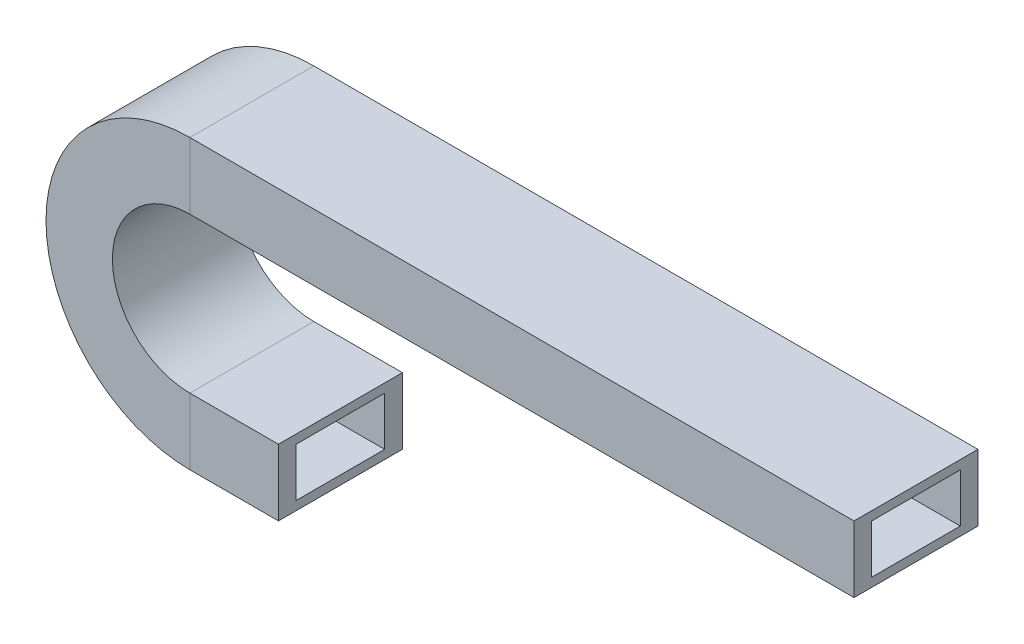
ISO-10303-21;
HEADER;
FILE_DESCRIPTION(('STEP AP214'),'2;1');
FILE_NAME('part.step','',(''),(''),'','','');
FILE_SCHEMA(('AUTOMOTIVE_DESIGN { 1 0 10303 214 1 1 1 1 }'));
ENDSEC;
DATA;
#1=APPLICATION_CONTEXT('core data for automotive mechanical design processes');
#2=APPLICATION_PROTOCOL_DEFINITION('international standard','automotive_design',2000,#1);
#3=PRODUCT_CONTEXT('',#1,'mechanical');
#4=PRODUCT('Part','Part','',(#3));
#5=PRODUCT_RELATED_PRODUCT_CATEGORY('part','',(#4));
#6=PRODUCT_DEFINITION_FORMATION('','',#4);
#7=PRODUCT_DEFINITION_CONTEXT('part definition',#1,'design');
#8=PRODUCT_DEFINITION('design','',#6,#7);
#9=PRODUCT_DEFINITION_SHAPE('','',#8);
#10=(LENGTH_UNIT() NAMED_UNIT(*) SI_UNIT(.MILLI.,.METRE.));
#11=(NAMED_UNIT(*) PLANE_ANGLE_UNIT() SI_UNIT($,.RADIAN.));
#12=(NAMED_UNIT(*) SI_UNIT($,.STERADIAN.) SOLID_ANGLE_UNIT());
#13=UNCERTAINTY_MEASURE_WITH_UNIT(LENGTH_MEASURE(1.E-05),#10,'distance_accuracy_value','');
#14=(GEOMETRIC_REPRESENTATION_CONTEXT(3) GLOBAL_UNCERTAINTY_ASSIGNED_CONTEXT((#13)) GLOBAL_UNIT_ASSIGNED_CONTEXT((#10,
#11,#12)) REPRESENTATION_CONTEXT('',''));
#15=CARTESIAN_POINT('',(0.,0.,0.));
#16=DIRECTION('',(0.,0.,1.));
#17=DIRECTION('',(1.,0.,0.));
#18=AXIS2_PLACEMENT_3D('',#15,#16,#17);
#19=CARTESIAN_POINT('',(0.,7.5,14.));
#20=DIRECTION('',(0.,0.,-1.));
#21=DIRECTION('',(0.,1.,0.));
#22=AXIS2_PLACEMENT_3D('',#19,#20,#21);
#23=PLANE('',#22);
#24=DIRECTION('',(-1.,0.,0.));
#25=VECTOR('',#24,1.);
#26=CARTESIAN_POINT('',(0.,-7.5,14.));
#27=LINE('',#26,#25);
#28=CARTESIAN_POINT('',(0.,-7.5,14.));
#29=VERTEX_POINT('',#28);
#30=CARTESIAN_POINT('',(-20.,-7.5,14.));
#31=VERTEX_POINT('',#30);
#32=EDGE_CURVE('E178',#29,#31,#27,.T.);
#33=ORIENTED_EDGE('',*,*,#32,.F.);
#34=DIRECTION('',(0.,-1.,0.));
#35=VECTOR('',#34,1.);
#36=CARTESIAN_POINT('',(0.,7.5,14.));
#37=LINE('',#36,#35);
#38=CARTESIAN_POINT('',(0.,7.5,14.));
#39=VERTEX_POINT('',#38);
#40=EDGE_CURVE('E207',#39,#29,#37,.T.);
#41=ORIENTED_EDGE('',*,*,#40,.F.);
#42=DIRECTION('',(-1.,0.,0.));
#43=VECTOR('',#42,1.);
#44=CARTESIAN_POINT('',(0.,7.5,14.));
#45=LINE('',#44,#43);
#46=CARTESIAN_POINT('',(-20.,7.5,14.));
#47=VERTEX_POINT('',#46);
#48=EDGE_CURVE('E204',#39,#47,#45,.T.);
#49=ORIENTED_EDGE('',*,*,#48,.T.);
#50=DIRECTION('',(0.,-1.,0.));
#51=VECTOR('',#50,1.);
#52=CARTESIAN_POINT('',(-20.,7.5,14.));
#53=LINE('',#52,#51);
#54=EDGE_CURVE('E200',#47,#31,#53,.T.);
#55=ORIENTED_EDGE('',*,*,#54,.T.);
#56=EDGE_LOOP('',(#33,#41,#49,#55));
#57=FACE_BOUND('',#56,.T.);
#58=ADVANCED_FACE('F35',(#57),#23,.F.);
#59=CARTESIAN_POINT('',(0.,-7.5,14.));
#60=DIRECTION('',(0.,1.,0.));
#61=DIRECTION('',(-1.,0.,0.));
#62=AXIS2_PLACEMENT_3D('',#59,#60,#61);
#63=PLANE('',#62);
#64=DIRECTION('',(-1.,0.,0.));
#65=VECTOR('',#64,1.);
#66=CARTESIAN_POINT('',(0.,-7.5,-14.));
#67=LINE('',#66,#65);
#68=CARTESIAN_POINT('',(0.,-7.5,-14.));
#69=VERTEX_POINT('',#68);
#70=CARTESIAN_POINT('',(-20.,-7.5,-14.));
#71=VERTEX_POINT('',#70);
#72=EDGE_CURVE('E142',#69,#71,#67,.T.);
#73=ORIENTED_EDGE('',*,*,#72,.F.);
#74=DIRECTION('',(0.,0.,-1.));
#75=VECTOR('',#74,1.);
#76=CARTESIAN_POINT('',(0.,-7.5,14.));
#77=LINE('',#76,#75);
#78=EDGE_CURVE('E161',#29,#69,#77,.T.);
#79=ORIENTED_EDGE('',*,*,#78,.F.);
#80=ORIENTED_EDGE('',*,*,#32,.T.);
#81=DIRECTION('',(0.,0.,-1.));
#82=VECTOR('',#81,1.);
#83=CARTESIAN_POINT('',(-20.,-7.5,14.));
#84=LINE('',#83,#82);
#85=EDGE_CURVE('E145',#31,#71,#84,.T.);
#86=ORIENTED_EDGE('',*,*,#85,.T.);
#87=EDGE_LOOP('',(#73,#79,#80,#86));
#88=FACE_BOUND('',#87,.T.);
#89=ADVANCED_FACE('F385',(#88),#63,.F.);
#90=CARTESIAN_POINT('',(0.,7.5,-14.));
#91=DIRECTION('',(0.,0.,1.));
#92=DIRECTION('',(0.,-1.,0.));
#93=AXIS2_PLACEMENT_3D('',#90,#91,#92);
#94=PLANE('',#93);
#95=DIRECTION('',(-1.,0.,0.));
#96=VECTOR('',#95,1.);
#97=CARTESIAN_POINT('',(0.,7.5,-14.));
#98=LINE('',#97,#96);
#99=CARTESIAN_POINT('',(0.,7.5,-14.));
#100=VERTEX_POINT('',#99);
#101=CARTESIAN_POINT('',(-20.,7.5,-14.));
#102=VERTEX_POINT('',#101);
#103=EDGE_CURVE('E132',#100,#102,#98,.T.);
#104=ORIENTED_EDGE('',*,*,#103,.F.);
#105=DIRECTION('',(0.,1.,0.));
#106=VECTOR('',#105,1.);
#107=CARTESIAN_POINT('',(0.,7.5,-14.));
#108=LINE('',#107,#106);
#109=EDGE_CURVE('E155',#69,#100,#108,.T.);
#110=ORIENTED_EDGE('',*,*,#109,.F.);
#111=ORIENTED_EDGE('',*,*,#72,.T.);
#112=DIRECTION('',(0.,1.,0.));
#113=VECTOR('',#112,1.);
#114=CARTESIAN_POINT('',(-20.,7.5,-14.));
#115=LINE('',#114,#113);
#116=EDGE_CURVE('E116',#71,#102,#115,.T.);
#117=ORIENTED_EDGE('',*,*,#116,.T.);
#118=EDGE_LOOP('',(#104,#110,#111,#117));
#119=FACE_BOUND('',#118,.T.);
#120=ADVANCED_FACE('F140',(#119),#94,.F.);
#121=CARTESIAN_POINT('',(0.,7.5,14.));
#122=DIRECTION('',(0.,-1.,0.));
#123=DIRECTION('',(1.,0.,0.));
#124=AXIS2_PLACEMENT_3D('',#121,#122,#123);
#125=PLANE('',#124);
#126=DIRECTION('',(0.,0.,1.));
#127=VECTOR('',#126,1.);
#128=CARTESIAN_POINT('',(-20.,7.5,14.));
#129=LINE('',#128,#127);
#130=EDGE_CURVE('E124',#102,#47,#129,.T.);
#131=ORIENTED_EDGE('',*,*,#130,.T.);
#132=ORIENTED_EDGE('',*,*,#48,.F.);
#133=DIRECTION('',(0.,0.,1.));
#134=VECTOR('',#133,1.);
#135=CARTESIAN_POINT('',(0.,7.5,14.));
#136=LINE('',#135,#134);
#137=EDGE_CURVE('E136',#100,#39,#136,.T.);
#138=ORIENTED_EDGE('',*,*,#137,.F.);
#139=ORIENTED_EDGE('',*,*,#103,.T.);
#140=EDGE_LOOP('',(#131,#132,#138,#139));
#141=FACE_BOUND('',#140,.T.);
#142=ADVANCED_FACE('F135',(#141),#125,.F.);
#143=CARTESIAN_POINT('',(-20.,7.5,14.));
#144=DIRECTION('',(0.,0.,-1.));
#145=DIRECTION('',(-1.,0.,0.));
#146=AXIS2_PLACEMENT_3D('',#143,#144,#145);
#147=PLANE('',#146);
#148=CARTESIAN_POINT('',(-20.,25.,14.));
#149=DIRECTION('',(0.,0.,-1.));
#150=DIRECTION('',(0.,-1.,0.));
#151=AXIS2_PLACEMENT_3D('',#148,#149,#150);
#152=CIRCLE('',#151,32.5);
#153=CARTESIAN_POINT('',(-20.,57.5,14.));
#154=VERTEX_POINT('',#153);
#155=EDGE_CURVE('E182',#31,#154,#152,.T.);
#156=ORIENTED_EDGE('',*,*,#155,.F.);
#157=ORIENTED_EDGE('',*,*,#54,.F.);
#158=CARTESIAN_POINT('',(-20.,25.,14.));
#159=DIRECTION('',(0.,0.,-1.));
#160=DIRECTION('',(0.,-1.,0.));
#161=AXIS2_PLACEMENT_3D('',#158,#159,#160);
#162=CIRCLE('',#161,17.5);
#163=CARTESIAN_POINT('',(-20.,42.5,14.));
#164=VERTEX_POINT('',#163);
#165=EDGE_CURVE('E128',#47,#164,#162,.T.);
#166=ORIENTED_EDGE('',*,*,#165,.T.);
#167=DIRECTION('',(0.,1.,0.));
#168=VECTOR('',#167,1.);
#169=CARTESIAN_POINT('',(-20.,42.5,14.));
#170=LINE('',#169,#168);
#171=EDGE_CURVE('E194',#164,#154,#170,.T.);
#172=ORIENTED_EDGE('',*,*,#171,.T.);
#173=EDGE_LOOP('',(#156,#157,#166,#172));
#174=FACE_BOUND('',#173,.T.);
#175=ADVANCED_FACE('F198',(#174),#147,.F.);
#176=CARTESIAN_POINT('',(-20.,25.,0.));
#177=DIRECTION('',(0.,0.,-1.));
#178=DIRECTION('',(-1.,0.,0.));
#179=AXIS2_PLACEMENT_3D('',#176,#177,#178);
#180=CYLINDRICAL_SURFACE('',#179,32.5);
#181=CARTESIAN_POINT('',(-20.,25.,-14.));
#182=DIRECTION('',(0.,0.,-1.));
#183=DIRECTION('',(0.,-1.,0.));
#184=AXIS2_PLACEMENT_3D('',#181,#182,#183);
#185=CIRCLE('',#184,32.5);
#186=CARTESIAN_POINT('',(-20.,57.5,-14.));
#187=VERTEX_POINT('',#186);
#188=EDGE_CURVE('E151',#71,#187,#185,.T.);
#189=ORIENTED_EDGE('',*,*,#188,.F.);
#190=ORIENTED_EDGE('',*,*,#85,.F.);
#191=ORIENTED_EDGE('',*,*,#155,.T.);
#192=DIRECTION('',(0.,0.,-1.));
#193=VECTOR('',#192,1.);
#194=CARTESIAN_POINT('',(-20.,57.5,14.));
#195=LINE('',#194,#193);
#196=EDGE_CURVE('E180',#154,#187,#195,.T.);
#197=ORIENTED_EDGE('',*,*,#196,.T.);
#198=EDGE_LOOP('',(#189,#190,#191,#197));
#199=FACE_BOUND('',#198,.T.);
#200=ADVANCED_FACE('F186',(#199),#180,.T.);
#201=CARTESIAN_POINT('',(-20.,7.5,-14.));
#202=DIRECTION('',(0.,0.,1.));
#203=DIRECTION('',(1.,0.,0.));
#204=AXIS2_PLACEMENT_3D('',#201,#202,#203);
#205=PLANE('',#204);
#206=CARTESIAN_POINT('',(-20.,25.,-14.));
#207=DIRECTION('',(0.,0.,-1.));
#208=DIRECTION('',(0.,-1.,0.));
#209=AXIS2_PLACEMENT_3D('',#206,#207,#208);
#210=CIRCLE('',#209,17.5);
#211=CARTESIAN_POINT('',(-20.,42.5,-14.));
#212=VERTEX_POINT('',#211);
#213=EDGE_CURVE('E111',#102,#212,#210,.T.);
#214=ORIENTED_EDGE('',*,*,#213,.F.);
#215=ORIENTED_EDGE('',*,*,#116,.F.);
#216=ORIENTED_EDGE('',*,*,#188,.T.);
#217=DIRECTION('',(0.,-1.,0.));
#218=VECTOR('',#217,1.);
#219=CARTESIAN_POINT('',(-20.,42.5,-14.));
#220=LINE('',#219,#218);
#221=EDGE_CURVE('E119',#187,#212,#220,.T.);
#222=ORIENTED_EDGE('',*,*,#221,.T.);
#223=EDGE_LOOP('',(#214,#215,#216,#222));
#224=FACE_BOUND('',#223,.T.);
#225=ADVANCED_FACE('F113',(#224),#205,.F.);
#226=CARTESIAN_POINT('',(-20.,25.,0.));
#227=DIRECTION('',(0.,0.,-1.));
#228=DIRECTION('',(-1.,0.,0.));
#229=AXIS2_PLACEMENT_3D('',#226,#227,#228);
#230=CYLINDRICAL_SURFACE('',#229,17.5);
#231=DIRECTION('',(0.,0.,1.));
#232=VECTOR('',#231,1.);
#233=CARTESIAN_POINT('',(-20.,42.5,14.));
#234=LINE('',#233,#232);
#235=EDGE_CURVE('E39',#212,#164,#234,.T.);
#236=ORIENTED_EDGE('',*,*,#235,.T.);
#237=ORIENTED_EDGE('',*,*,#165,.F.);
#238=ORIENTED_EDGE('',*,*,#130,.F.);
#239=ORIENTED_EDGE('',*,*,#213,.T.);
#240=EDGE_LOOP('',(#236,#237,#238,#239));
#241=FACE_BOUND('',#240,.T.);
#242=ADVANCED_FACE('F126',(#241),#230,.F.);
#243=CARTESIAN_POINT('',(-20.,42.5,14.));
#244=DIRECTION('',(0.,0.,-1.));
#245=DIRECTION('',(0.,1.,0.));
#246=AXIS2_PLACEMENT_3D('',#243,#244,#245);
#247=PLANE('',#246);
#248=DIRECTION('',(1.,0.,0.));
#249=VECTOR('',#248,1.);
#250=CARTESIAN_POINT('',(-20.,57.5,14.));
#251=LINE('',#250,#249);
#252=CARTESIAN_POINT('',(130.,57.5,14.));
#253=VERTEX_POINT('',#252);
#254=EDGE_CURVE('E164',#154,#253,#251,.T.);
#255=ORIENTED_EDGE('',*,*,#254,.F.);
#256=ORIENTED_EDGE('',*,*,#171,.F.);
#257=DIRECTION('',(1.,0.,0.));
#258=VECTOR('',#257,1.);
#259=CARTESIAN_POINT('',(-20.,42.5,14.));
#260=LINE('',#259,#258);
#261=CARTESIAN_POINT('',(130.,42.5,14.));
#262=VERTEX_POINT('',#261);
#263=EDGE_CURVE('E168',#164,#262,#260,.T.);
#264=ORIENTED_EDGE('',*,*,#263,.T.);
#265=DIRECTION('',(0.,1.,0.));
#266=VECTOR('',#265,1.);
#267=CARTESIAN_POINT('',(130.,42.5,14.));
#268=LINE('',#267,#266);
#269=EDGE_CURVE('E219',#262,#253,#268,.T.);
#270=ORIENTED_EDGE('',*,*,#269,.T.);
#271=EDGE_LOOP('',(#255,#256,#264,#270));
#272=FACE_BOUND('',#271,.T.);
#273=ADVANCED_FACE('F195',(#272),#247,.F.);
#274=CARTESIAN_POINT('',(-20.,57.5,14.));
#275=DIRECTION('',(0.,-1.,0.));
#276=DIRECTION('',(1.,0.,0.));
#277=AXIS2_PLACEMENT_3D('',#274,#275,#276);
#278=PLANE('',#277);
#279=DIRECTION('',(1.,0.,0.));
#280=VECTOR('',#279,1.);
#281=CARTESIAN_POINT('',(-20.,57.5,-14.));
#282=LINE('',#281,#280);
#283=CARTESIAN_POINT('',(130.,57.5,-14.));
#284=VERTEX_POINT('',#283);
#285=EDGE_CURVE('E148',#187,#284,#282,.T.);
#286=ORIENTED_EDGE('',*,*,#285,.F.);
#287=ORIENTED_EDGE('',*,*,#196,.F.);
#288=ORIENTED_EDGE('',*,*,#254,.T.);
#289=DIRECTION('',(0.,0.,-1.));
#290=VECTOR('',#289,1.);
#291=CARTESIAN_POINT('',(130.,57.5,14.));
#292=LINE('',#291,#290);
#293=EDGE_CURVE('E189',#253,#284,#292,.T.);
#294=ORIENTED_EDGE('',*,*,#293,.T.);
#295=EDGE_LOOP('',(#286,#287,#288,#294));
#296=FACE_BOUND('',#295,.T.);
#297=ADVANCED_FACE('F188',(#296),#278,.F.);
#298=CARTESIAN_POINT('',(-20.,42.5,-14.));
#299=DIRECTION('',(0.,0.,1.));
#300=DIRECTION('',(0.,-1.,0.));
#301=AXIS2_PLACEMENT_3D('',#298,#299,#300);
#302=PLANE('',#301);
#303=DIRECTION('',(1.,0.,0.));
#304=VECTOR('',#303,1.);
#305=CARTESIAN_POINT('',(-20.,42.5,-14.));
#306=LINE('',#305,#304);
#307=CARTESIAN_POINT('',(130.,42.5,-14.));
#308=VERTEX_POINT('',#307);
#309=EDGE_CURVE('E153',#212,#308,#306,.T.);
#310=ORIENTED_EDGE('',*,*,#309,.F.);
#311=ORIENTED_EDGE('',*,*,#221,.F.);
#312=ORIENTED_EDGE('',*,*,#285,.T.);
#313=DIRECTION('',(0.,-1.,0.));
#314=VECTOR('',#313,1.);
#315=CARTESIAN_POINT('',(130.,42.5,-14.));
#316=LINE('',#315,#314);
#317=EDGE_CURVE('E191',#284,#308,#316,.T.);
#318=ORIENTED_EDGE('',*,*,#317,.T.);
#319=EDGE_LOOP('',(#310,#311,#312,#318));
#320=FACE_BOUND('',#319,.T.);
#321=ADVANCED_FACE('F190',(#320),#302,.F.);
#322=CARTESIAN_POINT('',(-20.,42.5,14.));
#323=DIRECTION('',(0.,1.,0.));
#324=DIRECTION('',(-1.,0.,0.));
#325=AXIS2_PLACEMENT_3D('',#322,#323,#324);
#326=PLANE('',#325);
#327=DIRECTION('',(0.,0.,1.));
#328=VECTOR('',#327,1.);
#329=CARTESIAN_POINT('',(130.,42.5,14.));
#330=LINE('',#329,#328);
#331=EDGE_CURVE('E216',#308,#262,#330,.T.);
#332=ORIENTED_EDGE('',*,*,#331,.T.);
#333=ORIENTED_EDGE('',*,*,#263,.F.);
#334=ORIENTED_EDGE('',*,*,#235,.F.);
#335=ORIENTED_EDGE('',*,*,#309,.T.);
#336=EDGE_LOOP('',(#332,#333,#334,#335));
#337=FACE_BOUND('',#336,.T.);
#338=ADVANCED_FACE('F37',(#337),#326,.F.);
#339=CARTESIAN_POINT('',(0.,0.,0.));
#340=DIRECTION('',(1.,0.,0.));
#341=DIRECTION('',(0.,0.,-1.));
#342=AXIS2_PLACEMENT_3D('',#339,#340,#341);
#343=PLANE('',#342);
#344=DIRECTION('',(0.,1.,0.));
#345=VECTOR('',#344,1.);
#346=CARTESIAN_POINT('',(0.,5.5,-10.));
#347=LINE('',#346,#345);
#348=CARTESIAN_POINT('',(0.,5.5,-10.));
#349=VERTEX_POINT('',#348);
#350=CARTESIAN_POINT('',(0.,-5.5,-10.));
#351=VERTEX_POINT('',#350);
#352=EDGE_CURVE('E232',#349,#351,#347,.F.);
#353=ORIENTED_EDGE('',*,*,#352,.T.);
#354=DIRECTION('',(0.,0.,-1.));
#355=VECTOR('',#354,1.);
#356=CARTESIAN_POINT('',(0.,-5.5,10.));
#357=LINE('',#356,#355);
#358=CARTESIAN_POINT('',(0.,-5.5,10.));
#359=VERTEX_POINT('',#358);
#360=EDGE_CURVE('E218',#351,#359,#357,.F.);
#361=ORIENTED_EDGE('',*,*,#360,.T.);
#362=DIRECTION('',(0.,-1.,0.));
#363=VECTOR('',#362,1.);
#364=CARTESIAN_POINT('',(0.,5.5,10.));
#365=LINE('',#364,#363);
#366=CARTESIAN_POINT('',(0.,5.5,10.));
#367=VERTEX_POINT('',#366);
#368=EDGE_CURVE('E255',#359,#367,#365,.F.);
#369=ORIENTED_EDGE('',*,*,#368,.T.);
#370=DIRECTION('',(0.,0.,1.));
#371=VECTOR('',#370,1.);
#372=CARTESIAN_POINT('',(0.,5.5,10.));
#373=LINE('',#372,#371);
#374=EDGE_CURVE('E236',#367,#349,#373,.F.);
#375=ORIENTED_EDGE('',*,*,#374,.T.);
#376=EDGE_LOOP('',(#353,#361,#369,#375));
#377=FACE_BOUND('',#376,.T.);
#378=ORIENTED_EDGE('',*,*,#109,.T.);
#379=ORIENTED_EDGE('',*,*,#137,.T.);
#380=ORIENTED_EDGE('',*,*,#40,.T.);
#381=ORIENTED_EDGE('',*,*,#78,.T.);
#382=EDGE_LOOP('',(#378,#379,#380,#381));
#383=FACE_BOUND('',#382,.T.);
#384=ADVANCED_FACE('F300',(#377,#383),#343,.T.);
#385=CARTESIAN_POINT('',(130.,50.,0.));
#386=DIRECTION('',(-1.,0.,0.));
#387=DIRECTION('',(0.,0.,-1.));
#388=AXIS2_PLACEMENT_3D('',#385,#386,#387);
#389=PLANE('',#388);
#390=DIRECTION('',(0.,-1.,0.));
#391=VECTOR('',#390,1.);
#392=CARTESIAN_POINT('',(130.,44.5,-10.));
#393=LINE('',#392,#391);
#394=CARTESIAN_POINT('',(130.,44.5,-10.));
#395=VERTEX_POINT('',#394);
#396=CARTESIAN_POINT('',(130.,55.5,-10.));
#397=VERTEX_POINT('',#396);
#398=EDGE_CURVE('E11',#395,#397,#393,.F.);
#399=ORIENTED_EDGE('',*,*,#398,.F.);
#400=DIRECTION('',(0.,0.,1.));
#401=VECTOR('',#400,1.);
#402=CARTESIAN_POINT('',(130.,44.5,10.));
#403=LINE('',#402,#401);
#404=CARTESIAN_POINT('',(130.,44.5,10.));
#405=VERTEX_POINT('',#404);
#406=EDGE_CURVE('E54',#405,#395,#403,.F.);
#407=ORIENTED_EDGE('',*,*,#406,.F.);
#408=DIRECTION('',(0.,1.,0.));
#409=VECTOR('',#408,1.);
#410=CARTESIAN_POINT('',(130.,44.5,10.));
#411=LINE('',#410,#409);
#412=CARTESIAN_POINT('',(130.,55.5,10.));
#413=VERTEX_POINT('',#412);
#414=EDGE_CURVE('E257',#413,#405,#411,.F.);
#415=ORIENTED_EDGE('',*,*,#414,.F.);
#416=DIRECTION('',(0.,0.,-1.));
#417=VECTOR('',#416,1.);
#418=CARTESIAN_POINT('',(130.,55.5,10.));
#419=LINE('',#418,#417);
#420=EDGE_CURVE('E276',#397,#413,#419,.F.);
#421=ORIENTED_EDGE('',*,*,#420,.F.);
#422=EDGE_LOOP('',(#399,#407,#415,#421));
#423=FACE_BOUND('',#422,.T.);
#424=ORIENTED_EDGE('',*,*,#317,.F.);
#425=ORIENTED_EDGE('',*,*,#293,.F.);
#426=ORIENTED_EDGE('',*,*,#269,.F.);
#427=ORIENTED_EDGE('',*,*,#331,.F.);
#428=EDGE_LOOP('',(#424,#425,#426,#427));
#429=FACE_BOUND('',#428,.T.);
#430=ADVANCED_FACE('F377',(#423,#429),#389,.F.);
#431=CARTESIAN_POINT('',(0.,-5.5,10.));
#432=DIRECTION('',(0.,-1.,0.));
#433=DIRECTION('',(1.,0.,0.));
#434=AXIS2_PLACEMENT_3D('',#431,#432,#433);
#435=PLANE('',#434);
#436=DIRECTION('',(-1.,0.,0.));
#437=VECTOR('',#436,1.);
#438=CARTESIAN_POINT('',(0.,-5.5,10.));
#439=LINE('',#438,#437);
#440=CARTESIAN_POINT('',(-20.,-5.5,10.));
#441=VERTEX_POINT('',#440);
#442=EDGE_CURVE('E271',#359,#441,#439,.T.);
#443=ORIENTED_EDGE('',*,*,#442,.F.);
#444=ORIENTED_EDGE('',*,*,#360,.F.);
#445=DIRECTION('',(-1.,0.,0.));
#446=VECTOR('',#445,1.);
#447=CARTESIAN_POINT('',(0.,-5.5,-10.));
#448=LINE('',#447,#446);
#449=CARTESIAN_POINT('',(-20.,-5.5,-10.));
#450=VERTEX_POINT('',#449);
#451=EDGE_CURVE('E235',#351,#450,#448,.T.);
#452=ORIENTED_EDGE('',*,*,#451,.T.);
#453=DIRECTION('',(0.,0.,-1.));
#454=VECTOR('',#453,1.);
#455=CARTESIAN_POINT('',(-20.,-5.5,10.));
#456=LINE('',#455,#454);
#457=EDGE_CURVE('E290',#450,#441,#456,.F.);
#458=ORIENTED_EDGE('',*,*,#457,.T.);
#459=EDGE_LOOP('',(#443,#444,#452,#458));
#460=FACE_BOUND('',#459,.T.);
#461=ADVANCED_FACE('F309',(#460),#435,.F.);
#462=CARTESIAN_POINT('',(0.,5.5,10.));
#463=DIRECTION('',(0.,0.,1.));
#464=DIRECTION('',(1.,0.,0.));
#465=AXIS2_PLACEMENT_3D('',#462,#463,#464);
#466=PLANE('',#465);
#467=DIRECTION('',(-1.,0.,0.));
#468=VECTOR('',#467,1.);
#469=CARTESIAN_POINT('',(0.,5.5,10.));
#470=LINE('',#469,#468);
#471=CARTESIAN_POINT('',(-20.,5.5,10.));
#472=VERTEX_POINT('',#471);
#473=EDGE_CURVE('E252',#367,#472,#470,.T.);
#474=ORIENTED_EDGE('',*,*,#473,.F.);
#475=ORIENTED_EDGE('',*,*,#368,.F.);
#476=ORIENTED_EDGE('',*,*,#442,.T.);
#477=DIRECTION('',(0.,-1.,0.));
#478=VECTOR('',#477,1.);
#479=CARTESIAN_POINT('',(-20.,5.5,10.));
#480=LINE('',#479,#478);
#481=EDGE_CURVE('E268',#441,#472,#480,.F.);
#482=ORIENTED_EDGE('',*,*,#481,.T.);
#483=EDGE_LOOP('',(#474,#475,#476,#482));
#484=FACE_BOUND('',#483,.T.);
#485=ADVANCED_FACE('F313',(#484),#466,.F.);
#486=CARTESIAN_POINT('',(0.,5.5,10.));
#487=DIRECTION('',(0.,1.,0.));
#488=DIRECTION('',(-1.,0.,0.));
#489=AXIS2_PLACEMENT_3D('',#486,#487,#488);
#490=PLANE('',#489);
#491=DIRECTION('',(-1.,0.,0.));
#492=VECTOR('',#491,1.);
#493=CARTESIAN_POINT('',(0.,5.5,-10.));
#494=LINE('',#493,#492);
#495=CARTESIAN_POINT('',(-20.,5.5,-10.));
#496=VERTEX_POINT('',#495);
#497=EDGE_CURVE('E231',#349,#496,#494,.T.);
#498=ORIENTED_EDGE('',*,*,#497,.F.);
#499=ORIENTED_EDGE('',*,*,#374,.F.);
#500=ORIENTED_EDGE('',*,*,#473,.T.);
#501=DIRECTION('',(0.,0.,1.));
#502=VECTOR('',#501,1.);
#503=CARTESIAN_POINT('',(-20.,5.5,10.));
#504=LINE('',#503,#502);
#505=EDGE_CURVE('E249',#472,#496,#504,.F.);
#506=ORIENTED_EDGE('',*,*,#505,.T.);
#507=EDGE_LOOP('',(#498,#499,#500,#506));
#508=FACE_BOUND('',#507,.T.);
#509=ADVANCED_FACE('F353',(#508),#490,.F.);
#510=CARTESIAN_POINT('',(0.,5.5,-10.));
#511=DIRECTION('',(0.,0.,-1.));
#512=DIRECTION('',(0.,1.,0.));
#513=AXIS2_PLACEMENT_3D('',#510,#511,#512);
#514=PLANE('',#513);
#515=DIRECTION('',(0.,1.,0.));
#516=VECTOR('',#515,1.);
#517=CARTESIAN_POINT('',(-20.,5.5,-10.));
#518=LINE('',#517,#516);
#519=EDGE_CURVE('E227',#496,#450,#518,.F.);
#520=ORIENTED_EDGE('',*,*,#519,.T.);
#521=ORIENTED_EDGE('',*,*,#451,.F.);
#522=ORIENTED_EDGE('',*,*,#352,.F.);
#523=ORIENTED_EDGE('',*,*,#497,.T.);
#524=EDGE_LOOP('',(#520,#521,#522,#523));
#525=FACE_BOUND('',#524,.T.);
#526=ADVANCED_FACE('F351',(#525),#514,.F.);
#527=CARTESIAN_POINT('',(-20.,25.,0.));
#528=DIRECTION('',(0.,0.,-1.));
#529=DIRECTION('',(-1.,0.,0.));
#530=AXIS2_PLACEMENT_3D('',#527,#528,#529);
#531=CYLINDRICAL_SURFACE('',#530,30.5);
#532=CARTESIAN_POINT('',(-20.,25.,10.));
#533=DIRECTION('',(0.,0.,-1.));
#534=DIRECTION('',(0.,-1.,0.));
#535=AXIS2_PLACEMENT_3D('',#532,#533,#534);
#536=CIRCLE('',#535,30.5);
#537=CARTESIAN_POINT('',(-20.,55.5,10.));
#538=VERTEX_POINT('',#537);
#539=EDGE_CURVE('E265',#441,#538,#536,.T.);
#540=ORIENTED_EDGE('',*,*,#539,.F.);
#541=ORIENTED_EDGE('',*,*,#457,.F.);
#542=CARTESIAN_POINT('',(-20.,25.,-10.));
#543=DIRECTION('',(0.,0.,-1.));
#544=DIRECTION('',(0.,-1.,0.));
#545=AXIS2_PLACEMENT_3D('',#542,#543,#544);
#546=CIRCLE('',#545,30.5);
#547=CARTESIAN_POINT('',(-20.,55.5,-10.));
#548=VERTEX_POINT('',#547);
#549=EDGE_CURVE('E230',#450,#548,#546,.T.);
#550=ORIENTED_EDGE('',*,*,#549,.T.);
#551=DIRECTION('',(0.,0.,-1.));
#552=VECTOR('',#551,1.);
#553=CARTESIAN_POINT('',(-20.,55.5,10.));
#554=LINE('',#553,#552);
#555=EDGE_CURVE('E283',#548,#538,#554,.F.);
#556=ORIENTED_EDGE('',*,*,#555,.T.);
#557=EDGE_LOOP('',(#540,#541,#550,#556));
#558=FACE_BOUND('',#557,.T.);
#559=ADVANCED_FACE('F360',(#558),#531,.F.);
#560=CARTESIAN_POINT('',(-20.,5.5,10.));
#561=DIRECTION('',(0.,0.,1.));
#562=DIRECTION('',(1.,0.,0.));
#563=AXIS2_PLACEMENT_3D('',#560,#561,#562);
#564=PLANE('',#563);
#565=CARTESIAN_POINT('',(-20.,25.,10.));
#566=DIRECTION('',(0.,0.,-1.));
#567=DIRECTION('',(0.,-1.,0.));
#568=AXIS2_PLACEMENT_3D('',#565,#566,#567);
#569=CIRCLE('',#568,19.5);
#570=CARTESIAN_POINT('',(-20.,44.5,10.));
#571=VERTEX_POINT('',#570);
#572=EDGE_CURVE('E246',#472,#571,#569,.T.);
#573=ORIENTED_EDGE('',*,*,#572,.F.);
#574=ORIENTED_EDGE('',*,*,#481,.F.);
#575=ORIENTED_EDGE('',*,*,#539,.T.);
#576=DIRECTION('',(0.,1.,0.));
#577=VECTOR('',#576,1.);
#578=CARTESIAN_POINT('',(-20.,44.5,10.));
#579=LINE('',#578,#577);
#580=EDGE_CURVE('E262',#538,#571,#579,.F.);
#581=ORIENTED_EDGE('',*,*,#580,.T.);
#582=EDGE_LOOP('',(#573,#574,#575,#581));
#583=FACE_BOUND('',#582,.T.);
#584=ADVANCED_FACE('F463',(#583),#564,.F.);
#585=CARTESIAN_POINT('',(-20.,25.,0.));
#586=DIRECTION('',(0.,0.,-1.));
#587=DIRECTION('',(-1.,0.,0.));
#588=AXIS2_PLACEMENT_3D('',#585,#586,#587);
#589=CYLINDRICAL_SURFACE('',#588,19.5);
#590=CARTESIAN_POINT('',(-20.,25.,-10.));
#591=DIRECTION('',(0.,0.,-1.));
#592=DIRECTION('',(0.,-1.,0.));
#593=AXIS2_PLACEMENT_3D('',#590,#591,#592);
#594=CIRCLE('',#593,19.5);
#595=CARTESIAN_POINT('',(-20.,44.5,-10.));
#596=VERTEX_POINT('',#595);
#597=EDGE_CURVE('E226',#496,#596,#594,.T.);
#598=ORIENTED_EDGE('',*,*,#597,.F.);
#599=ORIENTED_EDGE('',*,*,#505,.F.);
#600=ORIENTED_EDGE('',*,*,#572,.T.);
#601=DIRECTION('',(0.,0.,1.));
#602=VECTOR('',#601,1.);
#603=CARTESIAN_POINT('',(-20.,44.5,10.));
#604=LINE('',#603,#602);
#605=EDGE_CURVE('E243',#571,#596,#604,.F.);
#606=ORIENTED_EDGE('',*,*,#605,.T.);
#607=EDGE_LOOP('',(#598,#599,#600,#606));
#608=FACE_BOUND('',#607,.T.);
#609=ADVANCED_FACE('F345',(#608),#589,.T.);
#610=CARTESIAN_POINT('',(-20.,5.5,-10.));
#611=DIRECTION('',(0.,0.,-1.));
#612=DIRECTION('',(-1.,0.,0.));
#613=AXIS2_PLACEMENT_3D('',#610,#611,#612);
#614=PLANE('',#613);
#615=DIRECTION('',(0.,-1.,0.));
#616=VECTOR('',#615,1.);
#617=CARTESIAN_POINT('',(-20.,44.5,-10.));
#618=LINE('',#617,#616);
#619=EDGE_CURVE('E222',#596,#548,#618,.F.);
#620=ORIENTED_EDGE('',*,*,#619,.T.);
#621=ORIENTED_EDGE('',*,*,#549,.F.);
#622=ORIENTED_EDGE('',*,*,#519,.F.);
#623=ORIENTED_EDGE('',*,*,#597,.T.);
#624=EDGE_LOOP('',(#620,#621,#622,#623));
#625=FACE_BOUND('',#624,.T.);
#626=ADVANCED_FACE('F348',(#625),#614,.F.);
#627=CARTESIAN_POINT('',(-20.,55.5,10.));
#628=DIRECTION('',(0.,1.,0.));
#629=DIRECTION('',(-1.,0.,0.));
#630=AXIS2_PLACEMENT_3D('',#627,#628,#629);
#631=PLANE('',#630);
#632=DIRECTION('',(1.,0.,0.));
#633=VECTOR('',#632,1.);
#634=CARTESIAN_POINT('',(-20.,55.5,10.));
#635=LINE('',#634,#633);
#636=EDGE_CURVE('E259',#538,#413,#635,.T.);
#637=ORIENTED_EDGE('',*,*,#636,.F.);
#638=ORIENTED_EDGE('',*,*,#555,.F.);
#639=DIRECTION('',(1.,0.,0.));
#640=VECTOR('',#639,1.);
#641=CARTESIAN_POINT('',(-20.,55.5,-10.));
#642=LINE('',#641,#640);
#643=EDGE_CURVE('E225',#548,#397,#642,.T.);
#644=ORIENTED_EDGE('',*,*,#643,.T.);
#645=ORIENTED_EDGE('',*,*,#420,.T.);
#646=EDGE_LOOP('',(#637,#638,#644,#645));
#647=FACE_BOUND('',#646,.T.);
#648=ADVANCED_FACE('F488',(#647),#631,.F.);
#649=CARTESIAN_POINT('',(-20.,44.5,10.));
#650=DIRECTION('',(0.,0.,1.));
#651=DIRECTION('',(1.,0.,0.));
#652=AXIS2_PLACEMENT_3D('',#649,#650,#651);
#653=PLANE('',#652);
#654=DIRECTION('',(1.,0.,0.));
#655=VECTOR('',#654,1.);
#656=CARTESIAN_POINT('',(-20.,44.5,10.));
#657=LINE('',#656,#655);
#658=EDGE_CURVE('E240',#571,#405,#657,.T.);
#659=ORIENTED_EDGE('',*,*,#658,.F.);
#660=ORIENTED_EDGE('',*,*,#580,.F.);
#661=ORIENTED_EDGE('',*,*,#636,.T.);
#662=ORIENTED_EDGE('',*,*,#414,.T.);
#663=EDGE_LOOP('',(#659,#660,#661,#662));
#664=FACE_BOUND('',#663,.T.);
#665=ADVANCED_FACE('F373',(#664),#653,.F.);
#666=CARTESIAN_POINT('',(-20.,44.5,10.));
#667=DIRECTION('',(0.,-1.,0.));
#668=DIRECTION('',(1.,0.,0.));
#669=AXIS2_PLACEMENT_3D('',#666,#667,#668);
#670=PLANE('',#669);
#671=DIRECTION('',(1.,0.,0.));
#672=VECTOR('',#671,1.);
#673=CARTESIAN_POINT('',(-20.,44.5,-10.));
#674=LINE('',#673,#672);
#675=EDGE_CURVE('E45',#596,#395,#674,.T.);
#676=ORIENTED_EDGE('',*,*,#675,.F.);
#677=ORIENTED_EDGE('',*,*,#605,.F.);
#678=ORIENTED_EDGE('',*,*,#658,.T.);
#679=ORIENTED_EDGE('',*,*,#406,.T.);
#680=EDGE_LOOP('',(#676,#677,#678,#679));
#681=FACE_BOUND('',#680,.T.);
#682=ADVANCED_FACE('F367',(#681),#670,.F.);
#683=CARTESIAN_POINT('',(-20.,44.5,-10.));
#684=DIRECTION('',(0.,0.,-1.));
#685=DIRECTION('',(0.,1.,0.));
#686=AXIS2_PLACEMENT_3D('',#683,#684,#685);
#687=PLANE('',#686);
#688=ORIENTED_EDGE('',*,*,#398,.T.);
#689=ORIENTED_EDGE('',*,*,#643,.F.);
#690=ORIENTED_EDGE('',*,*,#619,.F.);
#691=ORIENTED_EDGE('',*,*,#675,.T.);
#692=EDGE_LOOP('',(#688,#689,#690,#691));
#693=FACE_BOUND('',#692,.T.);
#694=ADVANCED_FACE('F365',(#693),#687,.F.);
#695=CLOSED_SHELL('',(#58,#89,#120,#142,#175,#200,#225,#242,#273,#297,#321,#338,#384,#430,#461,
#485,#509,#526,#559,#584,#609,#626,#648,#665,#682,#694));
#696=MANIFOLD_SOLID_BREP('B2',#695);
#697=ADVANCED_BREP_SHAPE_REPRESENTATION('',(#18,#696),#14);
#698=SHAPE_DEFINITION_REPRESENTATION(#9,#697);
ENDSEC;
END-ISO-10303-21;
